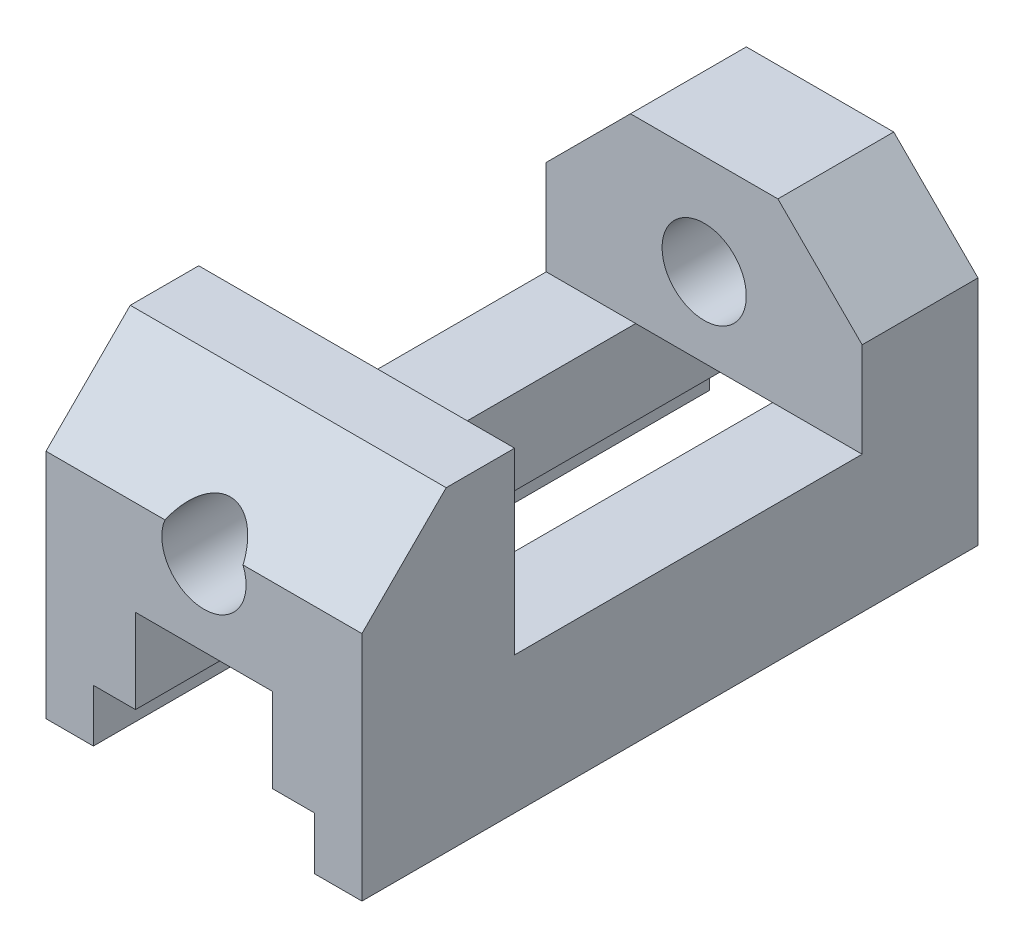
ISO-10303-21;
HEADER;
FILE_DESCRIPTION(('STEP AP214'),'2;1');
FILE_NAME('part.step','',(''),(''),'','','');
FILE_SCHEMA(('AUTOMOTIVE_DESIGN { 1 0 10303 214 1 1 1 1 }'));
ENDSEC;
DATA;
#1=APPLICATION_CONTEXT('core data for automotive mechanical design processes');
#2=APPLICATION_PROTOCOL_DEFINITION('international standard','automotive_design',2000,#1);
#3=PRODUCT_CONTEXT('',#1,'mechanical');
#4=PRODUCT('Part','Part','',(#3));
#5=PRODUCT_RELATED_PRODUCT_CATEGORY('part','',(#4));
#6=PRODUCT_DEFINITION_FORMATION('','',#4);
#7=PRODUCT_DEFINITION_CONTEXT('part definition',#1,'design');
#8=PRODUCT_DEFINITION('design','',#6,#7);
#9=PRODUCT_DEFINITION_SHAPE('','',#8);
#10=(LENGTH_UNIT() NAMED_UNIT(*) SI_UNIT(.MILLI.,.METRE.));
#11=(NAMED_UNIT(*) PLANE_ANGLE_UNIT() SI_UNIT($,.RADIAN.));
#12=(NAMED_UNIT(*) SI_UNIT($,.STERADIAN.) SOLID_ANGLE_UNIT());
#13=UNCERTAINTY_MEASURE_WITH_UNIT(LENGTH_MEASURE(1.E-05),#10,'distance_accuracy_value','');
#14=(GEOMETRIC_REPRESENTATION_CONTEXT(3) GLOBAL_UNCERTAINTY_ASSIGNED_CONTEXT((#13)) GLOBAL_UNIT_ASSIGNED_CONTEXT((#10,
#11,#12)) REPRESENTATION_CONTEXT('',''));
#15=CARTESIAN_POINT('',(0.,0.,0.));
#16=DIRECTION('',(0.,0.,1.));
#17=DIRECTION('',(1.,0.,0.));
#18=AXIS2_PLACEMENT_3D('',#15,#16,#17);
#19=CARTESIAN_POINT('',(0.,19.,117.));
#20=DIRECTION('',(0.,-1.,0.));
#21=DIRECTION('',(1.,0.,0.));
#22=AXIS2_PLACEMENT_3D('',#19,#20,#21);
#23=PLANE('',#22);
#24=DIRECTION('',(0.,0.,-1.));
#25=VECTOR('',#24,1.);
#26=CARTESIAN_POINT('',(14.,19.,44.6274169979694));
#27=LINE('',#26,#25);
#28=CARTESIAN_POINT('',(14.,19.,22.));
#29=VERTEX_POINT('',#28);
#30=CARTESIAN_POINT('',(14.,19.,0.));
#31=VERTEX_POINT('',#30);
#32=EDGE_CURVE('E67',#29,#31,#27,.T.);
#33=ORIENTED_EDGE('',*,*,#32,.T.);
#34=DIRECTION('',(-1.,0.,0.));
#35=VECTOR('',#34,1.);
#36=CARTESIAN_POINT('',(0.,19.,0.));
#37=LINE('',#36,#35);
#38=CARTESIAN_POINT('',(-14.,19.,0.));
#39=VERTEX_POINT('',#38);
#40=EDGE_CURVE('E204',#31,#39,#37,.T.);
#41=ORIENTED_EDGE('',*,*,#40,.T.);
#42=DIRECTION('',(0.,0.,-1.));
#43=VECTOR('',#42,1.);
#44=CARTESIAN_POINT('',(-14.,19.,44.6274169979694));
#45=LINE('',#44,#43);
#46=CARTESIAN_POINT('',(-14.,19.,22.));
#47=VERTEX_POINT('',#46);
#48=EDGE_CURVE('E430',#47,#39,#45,.T.);
#49=ORIENTED_EDGE('',*,*,#48,.F.);
#50=DIRECTION('',(1.,0.,0.));
#51=VECTOR('',#50,1.);
#52=CARTESIAN_POINT('',(-30.,19.,22.));
#53=LINE('',#52,#51);
#54=EDGE_CURVE('E206',#47,#29,#53,.T.);
#55=ORIENTED_EDGE('',*,*,#54,.T.);
#56=EDGE_LOOP('',(#33,#41,#49,#55));
#57=FACE_BOUND('',#56,.T.);
#58=ADVANCED_FACE('F41',(#57),#23,.F.);
#59=CARTESIAN_POINT('',(30.,0.,117.));
#60=DIRECTION('',(1.,0.,0.));
#61=DIRECTION('',(0.,1.,0.));
#62=AXIS2_PLACEMENT_3D('',#59,#60,#61);
#63=PLANE('',#62);
#64=DIRECTION('',(0.,-1.,0.));
#65=VECTOR('',#64,1.);
#66=CARTESIAN_POINT('',(30.,0.,0.));
#67=LINE('',#66,#65);
#68=CARTESIAN_POINT('',(30.,3.00000000000018,0.));
#69=VERTEX_POINT('',#68);
#70=CARTESIAN_POINT('',(30.,-41.,0.));
#71=VERTEX_POINT('',#70);
#72=EDGE_CURVE('E216',#69,#71,#67,.T.);
#73=ORIENTED_EDGE('',*,*,#72,.F.);
#74=DIRECTION('',(0.,0.,-1.));
#75=VECTOR('',#74,1.);
#76=CARTESIAN_POINT('',(30.,3.00000000000018,44.6274169979694));
#77=LINE('',#76,#75);
#78=CARTESIAN_POINT('',(30.,3.00000000000018,22.));
#79=VERTEX_POINT('',#78);
#80=EDGE_CURVE('E193',#79,#69,#77,.T.);
#81=ORIENTED_EDGE('',*,*,#80,.F.);
#82=DIRECTION('',(0.,1.,0.));
#83=VECTOR('',#82,1.);
#84=CARTESIAN_POINT('',(30.,-15.,22.));
#85=LINE('',#84,#83);
#86=CARTESIAN_POINT('',(30.,-15.,22.));
#87=VERTEX_POINT('',#86);
#88=EDGE_CURVE('E455',#87,#79,#85,.T.);
#89=ORIENTED_EDGE('',*,*,#88,.F.);
#90=DIRECTION('',(0.,0.,-1.));
#91=VECTOR('',#90,1.);
#92=CARTESIAN_POINT('',(30.,-15.,88.));
#93=LINE('',#92,#91);
#94=CARTESIAN_POINT('',(30.,-15.,88.));
#95=VERTEX_POINT('',#94);
#96=EDGE_CURVE('E451',#95,#87,#93,.T.);
#97=ORIENTED_EDGE('',*,*,#96,.F.);
#98=DIRECTION('',(0.,-1.,0.));
#99=VECTOR('',#98,1.);
#100=CARTESIAN_POINT('',(30.,19.,88.));
#101=LINE('',#100,#99);
#102=CARTESIAN_POINT('',(30.,19.,88.));
#103=VERTEX_POINT('',#102);
#104=EDGE_CURVE('E447',#103,#95,#101,.T.);
#105=ORIENTED_EDGE('',*,*,#104,.F.);
#106=DIRECTION('',(0.,0.,-1.));
#107=VECTOR('',#106,1.);
#108=CARTESIAN_POINT('',(30.,19.,117.));
#109=LINE('',#108,#107);
#110=CARTESIAN_POINT('',(30.,19.,101.));
#111=VERTEX_POINT('',#110);
#112=EDGE_CURVE('E256',#111,#103,#109,.T.);
#113=ORIENTED_EDGE('',*,*,#112,.F.);
#114=DIRECTION('',(0.,0.707106781186546,-0.707106781186549));
#115=VECTOR('',#114,1.);
#116=CARTESIAN_POINT('',(30.,3.,117.));
#117=LINE('',#116,#115);
#118=CARTESIAN_POINT('',(30.,3.,117.));
#119=VERTEX_POINT('',#118);
#120=EDGE_CURVE('E438',#119,#111,#117,.T.);
#121=ORIENTED_EDGE('',*,*,#120,.F.);
#122=DIRECTION('',(0.,-1.,0.));
#123=VECTOR('',#122,1.);
#124=CARTESIAN_POINT('',(30.,0.,117.));
#125=LINE('',#124,#123);
#126=CARTESIAN_POINT('',(30.,-41.,117.));
#127=VERTEX_POINT('',#126);
#128=EDGE_CURVE('E337',#119,#127,#125,.T.);
#129=ORIENTED_EDGE('',*,*,#128,.T.);
#130=DIRECTION('',(0.,0.,-1.));
#131=VECTOR('',#130,1.);
#132=CARTESIAN_POINT('',(30.,-41.,117.));
#133=LINE('',#132,#131);
#134=EDGE_CURVE('E260',#127,#71,#133,.T.);
#135=ORIENTED_EDGE('',*,*,#134,.T.);
#136=EDGE_LOOP('',(#73,#81,#89,#97,#105,#113,#121,#129,#135));
#137=FACE_BOUND('',#136,.T.);
#138=ADVANCED_FACE('F497',(#137),#63,.T.);
#139=CARTESIAN_POINT('',(0.,0.,0.));
#140=DIRECTION('',(0.,0.,1.));
#141=DIRECTION('',(1.,0.,0.));
#142=AXIS2_PLACEMENT_3D('',#139,#140,#141);
#143=PLANE('',#142);
#144=CARTESIAN_POINT('',(0.,0.,0.));
#145=DIRECTION('',(0.,0.,1.));
#146=DIRECTION('',(1.,0.,0.));
#147=AXIS2_PLACEMENT_3D('',#144,#145,#146);
#148=CIRCLE('',#147,8.);
#149=CARTESIAN_POINT('',(8.,0.,0.));
#150=VERTEX_POINT('',#149);
#151=EDGE_CURVE('E310',#150,#150,#148,.T.);
#152=ORIENTED_EDGE('',*,*,#151,.T.);
#153=EDGE_LOOP('',(#152));
#154=FACE_BOUND('',#153,.T.);
#155=DIRECTION('',(0.707106781186551,-0.707106781186544,0.));
#156=VECTOR('',#155,1.);
#157=CARTESIAN_POINT('',(16.4999999999999,16.5000000000001,0.));
#158=LINE('',#157,#156);
#159=EDGE_CURVE('E190',#31,#69,#158,.T.);
#160=ORIENTED_EDGE('',*,*,#159,.T.);
#161=ORIENTED_EDGE('',*,*,#72,.T.);
#162=DIRECTION('',(-1.,0.,0.));
#163=VECTOR('',#162,1.);
#164=CARTESIAN_POINT('',(0.,-41.,0.));
#165=LINE('',#164,#163);
#166=CARTESIAN_POINT('',(21.,-41.,0.));
#167=VERTEX_POINT('',#166);
#168=EDGE_CURVE('E222',#71,#167,#165,.T.);
#169=ORIENTED_EDGE('',*,*,#168,.T.);
#170=DIRECTION('',(0.,1.,0.));
#171=VECTOR('',#170,1.);
#172=CARTESIAN_POINT('',(21.,0.,0.));
#173=LINE('',#172,#171);
#174=CARTESIAN_POINT('',(21.,-31.,0.));
#175=VERTEX_POINT('',#174);
#176=EDGE_CURVE('E370',#167,#175,#173,.T.);
#177=ORIENTED_EDGE('',*,*,#176,.T.);
#178=DIRECTION('',(-1.,0.,0.));
#179=VECTOR('',#178,1.);
#180=CARTESIAN_POINT('',(0.,-31.,0.));
#181=LINE('',#180,#179);
#182=CARTESIAN_POINT('',(13.,-31.,0.));
#183=VERTEX_POINT('',#182);
#184=EDGE_CURVE('E366',#175,#183,#181,.T.);
#185=ORIENTED_EDGE('',*,*,#184,.T.);
#186=DIRECTION('',(0.,1.,0.));
#187=VECTOR('',#186,1.);
#188=CARTESIAN_POINT('',(13.,0.,0.));
#189=LINE('',#188,#187);
#190=CARTESIAN_POINT('',(13.,-15.,0.));
#191=VERTEX_POINT('',#190);
#192=EDGE_CURVE('E362',#183,#191,#189,.T.);
#193=ORIENTED_EDGE('',*,*,#192,.T.);
#194=DIRECTION('',(-1.,0.,0.));
#195=VECTOR('',#194,1.);
#196=CARTESIAN_POINT('',(0.,-15.,0.));
#197=LINE('',#196,#195);
#198=CARTESIAN_POINT('',(-13.,-15.,0.));
#199=VERTEX_POINT('',#198);
#200=EDGE_CURVE('E358',#191,#199,#197,.T.);
#201=ORIENTED_EDGE('',*,*,#200,.T.);
#202=DIRECTION('',(0.,1.,0.));
#203=VECTOR('',#202,1.);
#204=CARTESIAN_POINT('',(-13.,0.,0.));
#205=LINE('',#204,#203);
#206=CARTESIAN_POINT('',(-13.,-31.,0.));
#207=VERTEX_POINT('',#206);
#208=EDGE_CURVE('E354',#207,#199,#205,.T.);
#209=ORIENTED_EDGE('',*,*,#208,.F.);
#210=DIRECTION('',(1.,0.,0.));
#211=VECTOR('',#210,1.);
#212=CARTESIAN_POINT('',(0.,-31.,0.));
#213=LINE('',#212,#211);
#214=CARTESIAN_POINT('',(-21.,-31.,0.));
#215=VERTEX_POINT('',#214);
#216=EDGE_CURVE('E231',#215,#207,#213,.T.);
#217=ORIENTED_EDGE('',*,*,#216,.F.);
#218=DIRECTION('',(0.,1.,0.));
#219=VECTOR('',#218,1.);
#220=CARTESIAN_POINT('',(-21.,0.,0.));
#221=LINE('',#220,#219);
#222=CARTESIAN_POINT('',(-21.,-41.,0.));
#223=VERTEX_POINT('',#222);
#224=EDGE_CURVE('E228',#223,#215,#221,.T.);
#225=ORIENTED_EDGE('',*,*,#224,.F.);
#226=DIRECTION('',(1.,0.,0.));
#227=VECTOR('',#226,1.);
#228=CARTESIAN_POINT('',(0.,-41.,0.));
#229=LINE('',#228,#227);
#230=CARTESIAN_POINT('',(-30.,-41.,0.));
#231=VERTEX_POINT('',#230);
#232=EDGE_CURVE('E220',#231,#223,#229,.T.);
#233=ORIENTED_EDGE('',*,*,#232,.F.);
#234=DIRECTION('',(0.,-1.,0.));
#235=VECTOR('',#234,1.);
#236=CARTESIAN_POINT('',(-30.,0.,0.));
#237=LINE('',#236,#235);
#238=CARTESIAN_POINT('',(-30.,3.00000000000018,0.));
#239=VERTEX_POINT('',#238);
#240=EDGE_CURVE('E215',#239,#231,#237,.T.);
#241=ORIENTED_EDGE('',*,*,#240,.F.);
#242=DIRECTION('',(-0.707106781186551,-0.707106781186544,0.));
#243=VECTOR('',#242,1.);
#244=CARTESIAN_POINT('',(-16.4999999999999,16.5000000000001,0.));
#245=LINE('',#244,#243);
#246=EDGE_CURVE('E213',#39,#239,#245,.T.);
#247=ORIENTED_EDGE('',*,*,#246,.F.);
#248=ORIENTED_EDGE('',*,*,#40,.F.);
#249=EDGE_LOOP('',(#160,#161,#169,#177,#185,#193,#201,#209,#217,#225,#233,#241,#247,#248));
#250=FACE_BOUND('',#249,.T.);
#251=ADVANCED_FACE('F211',(#154,#250),#143,.F.);
#252=CARTESIAN_POINT('',(-30.,-15.,22.));
#253=DIRECTION('',(0.,0.,-1.));
#254=DIRECTION('',(-1.,0.,0.));
#255=AXIS2_PLACEMENT_3D('',#252,#253,#254);
#256=PLANE('',#255);
#257=CARTESIAN_POINT('',(0.,0.,22.));
#258=DIRECTION('',(0.,0.,-1.));
#259=DIRECTION('',(-1.,0.,0.));
#260=AXIS2_PLACEMENT_3D('',#257,#258,#259);
#261=CIRCLE('',#260,8.);
#262=CARTESIAN_POINT('',(-8.,0.,22.));
#263=VERTEX_POINT('',#262);
#264=EDGE_CURVE('E45',#263,#263,#261,.T.);
#265=ORIENTED_EDGE('',*,*,#264,.T.);
#266=EDGE_LOOP('',(#265));
#267=FACE_BOUND('',#266,.T.);
#268=DIRECTION('',(-0.707106781186551,0.707106781186544,0.));
#269=VECTOR('',#268,1.);
#270=CARTESIAN_POINT('',(16.4999999999999,16.5000000000001,22.));
#271=LINE('',#270,#269);
#272=EDGE_CURVE('E208',#79,#29,#271,.T.);
#273=ORIENTED_EDGE('',*,*,#272,.T.);
#274=ORIENTED_EDGE('',*,*,#54,.F.);
#275=DIRECTION('',(0.707106781186551,0.707106781186544,0.));
#276=VECTOR('',#275,1.);
#277=CARTESIAN_POINT('',(-16.4999999999999,16.5000000000001,22.));
#278=LINE('',#277,#276);
#279=CARTESIAN_POINT('',(-30.,3.00000000000018,22.));
#280=VERTEX_POINT('',#279);
#281=EDGE_CURVE('E198',#280,#47,#278,.T.);
#282=ORIENTED_EDGE('',*,*,#281,.F.);
#283=DIRECTION('',(0.,1.,0.));
#284=VECTOR('',#283,1.);
#285=CARTESIAN_POINT('',(-30.,-15.,22.));
#286=LINE('',#285,#284);
#287=CARTESIAN_POINT('',(-30.,-15.,22.));
#288=VERTEX_POINT('',#287);
#289=EDGE_CURVE('E428',#288,#280,#286,.T.);
#290=ORIENTED_EDGE('',*,*,#289,.F.);
#291=DIRECTION('',(1.,0.,0.));
#292=VECTOR('',#291,1.);
#293=CARTESIAN_POINT('',(-30.,-15.,22.));
#294=LINE('',#293,#292);
#295=CARTESIAN_POINT('',(-13.,-15.,22.));
#296=VERTEX_POINT('',#295);
#297=EDGE_CURVE('E470',#288,#296,#294,.T.);
#298=ORIENTED_EDGE('',*,*,#297,.T.);
#299=CARTESIAN_POINT('',(13.,-15.,22.));
#300=VERTEX_POINT('',#299);
#301=EDGE_CURVE('E401',#296,#300,#294,.T.);
#302=ORIENTED_EDGE('',*,*,#301,.T.);
#303=EDGE_CURVE('E473',#300,#87,#294,.T.);
#304=ORIENTED_EDGE('',*,*,#303,.T.);
#305=ORIENTED_EDGE('',*,*,#88,.T.);
#306=EDGE_LOOP('',(#273,#274,#282,#290,#298,#302,#304,#305));
#307=FACE_BOUND('',#306,.T.);
#308=ADVANCED_FACE('F601',(#267,#307),#256,.F.);
#309=CARTESIAN_POINT('',(0.,-15.,117.));
#310=DIRECTION('',(0.,-1.,0.));
#311=DIRECTION('',(0.,0.,-1.));
#312=AXIS2_PLACEMENT_3D('',#309,#310,#311);
#313=PLANE('',#312);
#314=ORIENTED_EDGE('',*,*,#301,.F.);
#315=DIRECTION('',(0.,0.,-1.));
#316=VECTOR('',#315,1.);
#317=CARTESIAN_POINT('',(-13.,-15.,117.));
#318=LINE('',#317,#316);
#319=EDGE_CURVE('E278',#296,#199,#318,.T.);
#320=ORIENTED_EDGE('',*,*,#319,.T.);
#321=ORIENTED_EDGE('',*,*,#200,.F.);
#322=DIRECTION('',(0.,0.,-1.));
#323=VECTOR('',#322,1.);
#324=CARTESIAN_POINT('',(13.,-15.,117.));
#325=LINE('',#324,#323);
#326=EDGE_CURVE('E273',#300,#191,#325,.T.);
#327=ORIENTED_EDGE('',*,*,#326,.F.);
#328=EDGE_LOOP('',(#314,#320,#321,#327));
#329=FACE_BOUND('',#328,.T.);
#330=ADVANCED_FACE('F399',(#329),#313,.T.);
#331=CARTESIAN_POINT('',(0.,0.,117.));
#332=DIRECTION('',(0.,0.,-1.));
#333=DIRECTION('',(-1.,0.,0.));
#334=AXIS2_PLACEMENT_3D('',#331,#332,#333);
#335=CYLINDRICAL_SURFACE('',#334,8.);
#336=ORIENTED_EDGE('',*,*,#264,.F.);
#337=EDGE_LOOP('',(#336));
#338=FACE_BOUND('',#337,.T.);
#339=ORIENTED_EDGE('',*,*,#151,.F.);
#340=EDGE_LOOP('',(#339));
#341=FACE_BOUND('',#340,.T.);
#342=ADVANCED_FACE('F509',(#338,#341),#335,.F.);
#343=CARTESIAN_POINT('',(-13.,0.,117.));
#344=DIRECTION('',(-1.,0.,0.));
#345=DIRECTION('',(0.,0.,1.));
#346=AXIS2_PLACEMENT_3D('',#343,#344,#345);
#347=PLANE('',#346);
#348=ORIENTED_EDGE('',*,*,#208,.T.);
#349=ORIENTED_EDGE('',*,*,#319,.F.);
#350=DIRECTION('',(0.,0.,1.));
#351=VECTOR('',#350,1.);
#352=CARTESIAN_POINT('',(-13.,-15.,117.));
#353=LINE('',#352,#351);
#354=CARTESIAN_POINT('',(-13.,-15.,88.));
#355=VERTEX_POINT('',#354);
#356=EDGE_CURVE('E306',#296,#355,#353,.T.);
#357=ORIENTED_EDGE('',*,*,#356,.T.);
#358=CARTESIAN_POINT('',(-13.,-15.,117.));
#359=VERTEX_POINT('',#358);
#360=EDGE_CURVE('E51',#359,#355,#318,.T.);
#361=ORIENTED_EDGE('',*,*,#360,.F.);
#362=DIRECTION('',(0.,1.,0.));
#363=VECTOR('',#362,1.);
#364=CARTESIAN_POINT('',(-13.,0.,117.));
#365=LINE('',#364,#363);
#366=CARTESIAN_POINT('',(-13.,-31.,117.));
#367=VERTEX_POINT('',#366);
#368=EDGE_CURVE('E314',#367,#359,#365,.T.);
#369=ORIENTED_EDGE('',*,*,#368,.F.);
#370=DIRECTION('',(0.,0.,-1.));
#371=VECTOR('',#370,1.);
#372=CARTESIAN_POINT('',(-13.,-31.,117.));
#373=LINE('',#372,#371);
#374=EDGE_CURVE('E235',#367,#207,#373,.T.);
#375=ORIENTED_EDGE('',*,*,#374,.T.);
#376=EDGE_LOOP('',(#348,#349,#357,#361,#369,#375));
#377=FACE_BOUND('',#376,.T.);
#378=ADVANCED_FACE('F404',(#377),#347,.F.);
#379=DIRECTION('',(1.,0.,0.));
#380=VECTOR('',#379,1.);
#381=CARTESIAN_POINT('',(-30.,-15.,88.));
#382=LINE('',#381,#380);
#383=CARTESIAN_POINT('',(13.,-15.,88.));
#384=VERTEX_POINT('',#383);
#385=EDGE_CURVE('E477',#355,#384,#382,.T.);
#386=ORIENTED_EDGE('',*,*,#385,.T.);
#387=CARTESIAN_POINT('',(13.,-15.,117.));
#388=VERTEX_POINT('',#387);
#389=EDGE_CURVE('E274',#388,#384,#325,.T.);
#390=ORIENTED_EDGE('',*,*,#389,.F.);
#391=DIRECTION('',(-1.,0.,0.));
#392=VECTOR('',#391,1.);
#393=CARTESIAN_POINT('',(0.,-15.,117.));
#394=LINE('',#393,#392);
#395=EDGE_CURVE('E317',#388,#359,#394,.T.);
#396=ORIENTED_EDGE('',*,*,#395,.T.);
#397=ORIENTED_EDGE('',*,*,#360,.T.);
#398=EDGE_LOOP('',(#386,#390,#396,#397));
#399=FACE_BOUND('',#398,.T.);
#400=ADVANCED_FACE('F540',(#399),#313,.T.);
#401=CARTESIAN_POINT('',(13.,0.,117.));
#402=DIRECTION('',(-1.,0.,0.));
#403=DIRECTION('',(0.,0.,1.));
#404=AXIS2_PLACEMENT_3D('',#401,#402,#403);
#405=PLANE('',#404);
#406=ORIENTED_EDGE('',*,*,#192,.F.);
#407=DIRECTION('',(0.,0.,-1.));
#408=VECTOR('',#407,1.);
#409=CARTESIAN_POINT('',(13.,-31.,117.));
#410=LINE('',#409,#408);
#411=CARTESIAN_POINT('',(13.,-31.,117.));
#412=VERTEX_POINT('',#411);
#413=EDGE_CURVE('E270',#412,#183,#410,.T.);
#414=ORIENTED_EDGE('',*,*,#413,.F.);
#415=DIRECTION('',(0.,1.,0.));
#416=VECTOR('',#415,1.);
#417=CARTESIAN_POINT('',(13.,0.,117.));
#418=LINE('',#417,#416);
#419=EDGE_CURVE('E321',#412,#388,#418,.T.);
#420=ORIENTED_EDGE('',*,*,#419,.T.);
#421=ORIENTED_EDGE('',*,*,#389,.T.);
#422=DIRECTION('',(0.,0.,1.));
#423=VECTOR('',#422,1.);
#424=CARTESIAN_POINT('',(13.,-15.,117.));
#425=LINE('',#424,#423);
#426=EDGE_CURVE('E290',#300,#384,#425,.T.);
#427=ORIENTED_EDGE('',*,*,#426,.F.);
#428=ORIENTED_EDGE('',*,*,#326,.T.);
#429=EDGE_LOOP('',(#406,#414,#420,#421,#427,#428));
#430=FACE_BOUND('',#429,.T.);
#431=ADVANCED_FACE('F392',(#430),#405,.T.);
#432=CARTESIAN_POINT('',(0.,-31.,117.));
#433=DIRECTION('',(0.,-1.,0.));
#434=DIRECTION('',(1.,0.,0.));
#435=AXIS2_PLACEMENT_3D('',#432,#433,#434);
#436=PLANE('',#435);
#437=ORIENTED_EDGE('',*,*,#184,.F.);
#438=DIRECTION('',(0.,0.,-1.));
#439=VECTOR('',#438,1.);
#440=CARTESIAN_POINT('',(21.,-31.,117.));
#441=LINE('',#440,#439);
#442=CARTESIAN_POINT('',(21.,-31.,117.));
#443=VERTEX_POINT('',#442);
#444=EDGE_CURVE('E267',#443,#175,#441,.T.);
#445=ORIENTED_EDGE('',*,*,#444,.F.);
#446=DIRECTION('',(-1.,0.,0.));
#447=VECTOR('',#446,1.);
#448=CARTESIAN_POINT('',(0.,-31.,117.));
#449=LINE('',#448,#447);
#450=EDGE_CURVE('E325',#443,#412,#449,.T.);
#451=ORIENTED_EDGE('',*,*,#450,.T.);
#452=ORIENTED_EDGE('',*,*,#413,.T.);
#453=EDGE_LOOP('',(#437,#445,#451,#452));
#454=FACE_BOUND('',#453,.T.);
#455=ADVANCED_FACE('F387',(#454),#436,.T.);
#456=CARTESIAN_POINT('',(21.,0.,117.));
#457=DIRECTION('',(-1.,0.,0.));
#458=DIRECTION('',(0.,0.,1.));
#459=AXIS2_PLACEMENT_3D('',#456,#457,#458);
#460=PLANE('',#459);
#461=ORIENTED_EDGE('',*,*,#176,.F.);
#462=DIRECTION('',(0.,0.,-1.));
#463=VECTOR('',#462,1.);
#464=CARTESIAN_POINT('',(21.,-41.,117.));
#465=LINE('',#464,#463);
#466=CARTESIAN_POINT('',(21.,-41.,117.));
#467=VERTEX_POINT('',#466);
#468=EDGE_CURVE('E264',#467,#167,#465,.T.);
#469=ORIENTED_EDGE('',*,*,#468,.F.);
#470=DIRECTION('',(0.,1.,0.));
#471=VECTOR('',#470,1.);
#472=CARTESIAN_POINT('',(21.,0.,117.));
#473=LINE('',#472,#471);
#474=EDGE_CURVE('E329',#467,#443,#473,.T.);
#475=ORIENTED_EDGE('',*,*,#474,.T.);
#476=ORIENTED_EDGE('',*,*,#444,.T.);
#477=EDGE_LOOP('',(#461,#469,#475,#476));
#478=FACE_BOUND('',#477,.T.);
#479=ADVANCED_FACE('F383',(#478),#460,.T.);
#480=CARTESIAN_POINT('',(0.,-41.,117.));
#481=DIRECTION('',(0.,-1.,0.));
#482=DIRECTION('',(0.,0.,-1.));
#483=AXIS2_PLACEMENT_3D('',#480,#481,#482);
#484=PLANE('',#483);
#485=ORIENTED_EDGE('',*,*,#168,.F.);
#486=ORIENTED_EDGE('',*,*,#134,.F.);
#487=DIRECTION('',(-1.,0.,0.));
#488=VECTOR('',#487,1.);
#489=CARTESIAN_POINT('',(0.,-41.,117.));
#490=LINE('',#489,#488);
#491=EDGE_CURVE('E333',#127,#467,#490,.T.);
#492=ORIENTED_EDGE('',*,*,#491,.T.);
#493=ORIENTED_EDGE('',*,*,#468,.T.);
#494=EDGE_LOOP('',(#485,#486,#492,#493));
#495=FACE_BOUND('',#494,.T.);
#496=ADVANCED_FACE('F379',(#495),#484,.T.);
#497=DIRECTION('',(0.,0.,-1.));
#498=VECTOR('',#497,1.);
#499=CARTESIAN_POINT('',(-30.,19.,117.));
#500=LINE('',#499,#498);
#501=CARTESIAN_POINT('',(-30.,19.,101.));
#502=VERTEX_POINT('',#501);
#503=CARTESIAN_POINT('',(-30.,19.,88.));
#504=VERTEX_POINT('',#503);
#505=EDGE_CURVE('E252',#502,#504,#500,.T.);
#506=ORIENTED_EDGE('',*,*,#505,.F.);
#507=DIRECTION('',(1.,0.,0.));
#508=VECTOR('',#507,1.);
#509=CARTESIAN_POINT('',(-30.,19.,101.));
#510=LINE('',#509,#508);
#511=EDGE_CURVE('E291',#502,#111,#510,.T.);
#512=ORIENTED_EDGE('',*,*,#511,.T.);
#513=ORIENTED_EDGE('',*,*,#112,.T.);
#514=DIRECTION('',(1.,0.,0.));
#515=VECTOR('',#514,1.);
#516=CARTESIAN_POINT('',(-30.,19.,88.));
#517=LINE('',#516,#515);
#518=EDGE_CURVE('E302',#504,#103,#517,.T.);
#519=ORIENTED_EDGE('',*,*,#518,.F.);
#520=EDGE_LOOP('',(#506,#512,#513,#519));
#521=FACE_BOUND('',#520,.T.);
#522=ADVANCED_FACE('F500',(#521),#23,.F.);
#523=CARTESIAN_POINT('',(-30.,0.,117.));
#524=DIRECTION('',(1.,0.,0.));
#525=DIRECTION('',(0.,1.,0.));
#526=AXIS2_PLACEMENT_3D('',#523,#524,#525);
#527=PLANE('',#526);
#528=ORIENTED_EDGE('',*,*,#289,.T.);
#529=DIRECTION('',(0.,0.,-1.));
#530=VECTOR('',#529,1.);
#531=CARTESIAN_POINT('',(-30.,3.00000000000018,44.6274169979694));
#532=LINE('',#531,#530);
#533=EDGE_CURVE('E59',#280,#239,#532,.T.);
#534=ORIENTED_EDGE('',*,*,#533,.T.);
#535=ORIENTED_EDGE('',*,*,#240,.T.);
#536=DIRECTION('',(0.,0.,-1.));
#537=VECTOR('',#536,1.);
#538=CARTESIAN_POINT('',(-30.,-41.,117.));
#539=LINE('',#538,#537);
#540=CARTESIAN_POINT('',(-30.,-41.,117.));
#541=VERTEX_POINT('',#540);
#542=EDGE_CURVE('E248',#541,#231,#539,.T.);
#543=ORIENTED_EDGE('',*,*,#542,.F.);
#544=DIRECTION('',(0.,-1.,0.));
#545=VECTOR('',#544,1.);
#546=CARTESIAN_POINT('',(-30.,0.,117.));
#547=LINE('',#546,#545);
#548=CARTESIAN_POINT('',(-30.,3.,117.));
#549=VERTEX_POINT('',#548);
#550=EDGE_CURVE('E340',#549,#541,#547,.T.);
#551=ORIENTED_EDGE('',*,*,#550,.F.);
#552=DIRECTION('',(0.,0.707106781186546,-0.707106781186549));
#553=VECTOR('',#552,1.);
#554=CARTESIAN_POINT('',(-30.,3.,117.));
#555=LINE('',#554,#553);
#556=EDGE_CURVE('E441',#549,#502,#555,.T.);
#557=ORIENTED_EDGE('',*,*,#556,.T.);
#558=ORIENTED_EDGE('',*,*,#505,.T.);
#559=DIRECTION('',(0.,-1.,0.));
#560=VECTOR('',#559,1.);
#561=CARTESIAN_POINT('',(-30.,19.,88.));
#562=LINE('',#561,#560);
#563=CARTESIAN_POINT('',(-30.,-15.,88.));
#564=VERTEX_POINT('',#563);
#565=EDGE_CURVE('E459',#504,#564,#562,.T.);
#566=ORIENTED_EDGE('',*,*,#565,.T.);
#567=DIRECTION('',(0.,0.,-1.));
#568=VECTOR('',#567,1.);
#569=CARTESIAN_POINT('',(-30.,-15.,88.));
#570=LINE('',#569,#568);
#571=EDGE_CURVE('E463',#564,#288,#570,.T.);
#572=ORIENTED_EDGE('',*,*,#571,.T.);
#573=EDGE_LOOP('',(#528,#534,#535,#543,#551,#557,#558,#566,#572));
#574=FACE_BOUND('',#573,.T.);
#575=ADVANCED_FACE('F424',(#574),#527,.F.);
#576=CARTESIAN_POINT('',(0.,-41.,117.));
#577=DIRECTION('',(0.,1.,0.));
#578=DIRECTION('',(0.,0.,1.));
#579=AXIS2_PLACEMENT_3D('',#576,#577,#578);
#580=PLANE('',#579);
#581=ORIENTED_EDGE('',*,*,#232,.T.);
#582=DIRECTION('',(0.,0.,-1.));
#583=VECTOR('',#582,1.);
#584=CARTESIAN_POINT('',(-21.,-41.,117.));
#585=LINE('',#584,#583);
#586=CARTESIAN_POINT('',(-21.,-41.,117.));
#587=VERTEX_POINT('',#586);
#588=EDGE_CURVE('E244',#587,#223,#585,.T.);
#589=ORIENTED_EDGE('',*,*,#588,.F.);
#590=DIRECTION('',(1.,0.,0.));
#591=VECTOR('',#590,1.);
#592=CARTESIAN_POINT('',(0.,-41.,117.));
#593=LINE('',#592,#591);
#594=EDGE_CURVE('E343',#541,#587,#593,.T.);
#595=ORIENTED_EDGE('',*,*,#594,.F.);
#596=ORIENTED_EDGE('',*,*,#542,.T.);
#597=EDGE_LOOP('',(#581,#589,#595,#596));
#598=FACE_BOUND('',#597,.T.);
#599=ADVANCED_FACE('F420',(#598),#580,.F.);
#600=CARTESIAN_POINT('',(-21.,0.,117.));
#601=DIRECTION('',(-1.,0.,0.));
#602=DIRECTION('',(0.,0.,1.));
#603=AXIS2_PLACEMENT_3D('',#600,#601,#602);
#604=PLANE('',#603);
#605=ORIENTED_EDGE('',*,*,#224,.T.);
#606=DIRECTION('',(0.,0.,-1.));
#607=VECTOR('',#606,1.);
#608=CARTESIAN_POINT('',(-21.,-31.,117.));
#609=LINE('',#608,#607);
#610=CARTESIAN_POINT('',(-21.,-31.,117.));
#611=VERTEX_POINT('',#610);
#612=EDGE_CURVE('E239',#611,#215,#609,.T.);
#613=ORIENTED_EDGE('',*,*,#612,.F.);
#614=DIRECTION('',(0.,1.,0.));
#615=VECTOR('',#614,1.);
#616=CARTESIAN_POINT('',(-21.,0.,117.));
#617=LINE('',#616,#615);
#618=EDGE_CURVE('E346',#587,#611,#617,.T.);
#619=ORIENTED_EDGE('',*,*,#618,.F.);
#620=ORIENTED_EDGE('',*,*,#588,.T.);
#621=EDGE_LOOP('',(#605,#613,#619,#620));
#622=FACE_BOUND('',#621,.T.);
#623=ADVANCED_FACE('F416',(#622),#604,.F.);
#624=CARTESIAN_POINT('',(0.,0.,120.));
#625=DIRECTION('',(0.,-0.707106781186549,-0.707106781186546));
#626=DIRECTION('',(0.,0.707106781186546,-0.707106781186549));
#627=AXIS2_PLACEMENT_3D('',#624,#625,#626);
#628=ELLIPSE('',#627,11.3137084989848,8.);
#629=CARTESIAN_POINT('',(-7.41619848709566,3.,117.));
#630=VERTEX_POINT('',#629);
#631=CARTESIAN_POINT('',(7.41619848709566,3.,117.));
#632=VERTEX_POINT('',#631);
#633=EDGE_CURVE('E284',#630,#632,#628,.T.);
#634=ORIENTED_EDGE('',*,*,#633,.F.);
#635=CARTESIAN_POINT('',(0.,0.,117.));
#636=DIRECTION('',(0.,0.,1.));
#637=DIRECTION('',(1.,0.,0.));
#638=AXIS2_PLACEMENT_3D('',#635,#636,#637);
#639=CIRCLE('',#638,8.);
#640=EDGE_CURVE('E234',#630,#632,#639,.T.);
#641=ORIENTED_EDGE('',*,*,#640,.T.);
#642=EDGE_LOOP('',(#634,#641));
#643=FACE_BOUND('',#642,.T.);
#644=CARTESIAN_POINT('',(0.,0.,88.));
#645=DIRECTION('',(0.,0.,1.));
#646=DIRECTION('',(1.,0.,0.));
#647=AXIS2_PLACEMENT_3D('',#644,#645,#646);
#648=CIRCLE('',#647,8.);
#649=CARTESIAN_POINT('',(8.,0.,88.));
#650=VERTEX_POINT('',#649);
#651=EDGE_CURVE('E281',#650,#650,#648,.T.);
#652=ORIENTED_EDGE('',*,*,#651,.F.);
#653=EDGE_LOOP('',(#652));
#654=FACE_BOUND('',#653,.T.);
#655=ADVANCED_FACE('F43',(#643,#654),#335,.F.);
#656=CARTESIAN_POINT('',(0.,-31.,117.));
#657=DIRECTION('',(0.,1.,0.));
#658=DIRECTION('',(-1.,0.,0.));
#659=AXIS2_PLACEMENT_3D('',#656,#657,#658);
#660=PLANE('',#659);
#661=ORIENTED_EDGE('',*,*,#216,.T.);
#662=ORIENTED_EDGE('',*,*,#374,.F.);
#663=DIRECTION('',(1.,0.,0.));
#664=VECTOR('',#663,1.);
#665=CARTESIAN_POINT('',(0.,-31.,117.));
#666=LINE('',#665,#664);
#667=EDGE_CURVE('E240',#611,#367,#666,.T.);
#668=ORIENTED_EDGE('',*,*,#667,.F.);
#669=ORIENTED_EDGE('',*,*,#612,.T.);
#670=EDGE_LOOP('',(#661,#662,#668,#669));
#671=FACE_BOUND('',#670,.T.);
#672=ADVANCED_FACE('F411',(#671),#660,.F.);
#673=CARTESIAN_POINT('',(0.,0.,117.));
#674=DIRECTION('',(0.,0.,1.));
#675=DIRECTION('',(1.,0.,0.));
#676=AXIS2_PLACEMENT_3D('',#673,#674,#675);
#677=PLANE('',#676);
#678=DIRECTION('',(1.,0.,0.));
#679=VECTOR('',#678,1.);
#680=CARTESIAN_POINT('',(-30.,3.,117.));
#681=LINE('',#680,#679);
#682=EDGE_CURVE('E298',#549,#630,#681,.T.);
#683=ORIENTED_EDGE('',*,*,#682,.F.);
#684=ORIENTED_EDGE('',*,*,#550,.T.);
#685=ORIENTED_EDGE('',*,*,#594,.T.);
#686=ORIENTED_EDGE('',*,*,#618,.T.);
#687=ORIENTED_EDGE('',*,*,#667,.T.);
#688=ORIENTED_EDGE('',*,*,#368,.T.);
#689=ORIENTED_EDGE('',*,*,#395,.F.);
#690=ORIENTED_EDGE('',*,*,#419,.F.);
#691=ORIENTED_EDGE('',*,*,#450,.F.);
#692=ORIENTED_EDGE('',*,*,#474,.F.);
#693=ORIENTED_EDGE('',*,*,#491,.F.);
#694=ORIENTED_EDGE('',*,*,#128,.F.);
#695=DIRECTION('',(1.,0.,0.));
#696=VECTOR('',#695,1.);
#697=CARTESIAN_POINT('',(0.,3.,117.));
#698=LINE('',#697,#696);
#699=EDGE_CURVE('E11',#632,#119,#698,.T.);
#700=ORIENTED_EDGE('',*,*,#699,.F.);
#701=ORIENTED_EDGE('',*,*,#640,.F.);
#702=EDGE_LOOP('',(#683,#684,#685,#686,#687,#688,#689,#690,#691,#692,#693,#694,#700,#701));
#703=FACE_BOUND('',#702,.T.);
#704=ADVANCED_FACE('F504',(#703),#677,.T.);
#705=CARTESIAN_POINT('',(-30.,3.,117.));
#706=DIRECTION('',(0.,-0.707106781186549,-0.707106781186546));
#707=DIRECTION('',(0.,0.707106781186546,-0.707106781186549));
#708=AXIS2_PLACEMENT_3D('',#705,#706,#707);
#709=PLANE('',#708);
#710=ORIENTED_EDGE('',*,*,#633,.T.);
#711=ORIENTED_EDGE('',*,*,#699,.T.);
#712=ORIENTED_EDGE('',*,*,#120,.T.);
#713=ORIENTED_EDGE('',*,*,#511,.F.);
#714=ORIENTED_EDGE('',*,*,#556,.F.);
#715=ORIENTED_EDGE('',*,*,#682,.T.);
#716=EDGE_LOOP('',(#710,#711,#712,#713,#714,#715));
#717=FACE_BOUND('',#716,.T.);
#718=ADVANCED_FACE('F501',(#717),#709,.F.);
#719=CARTESIAN_POINT('',(-30.,-15.,88.));
#720=DIRECTION('',(0.,-1.,0.));
#721=DIRECTION('',(0.,0.,-1.));
#722=AXIS2_PLACEMENT_3D('',#719,#720,#721);
#723=PLANE('',#722);
#724=ORIENTED_EDGE('',*,*,#297,.F.);
#725=ORIENTED_EDGE('',*,*,#571,.F.);
#726=EDGE_CURVE('E474',#564,#355,#382,.T.);
#727=ORIENTED_EDGE('',*,*,#726,.T.);
#728=ORIENTED_EDGE('',*,*,#356,.F.);
#729=EDGE_LOOP('',(#724,#725,#727,#728));
#730=FACE_BOUND('',#729,.T.);
#731=ADVANCED_FACE('F627',(#730),#723,.F.);
#732=ORIENTED_EDGE('',*,*,#426,.T.);
#733=EDGE_CURVE('E478',#384,#95,#382,.T.);
#734=ORIENTED_EDGE('',*,*,#733,.T.);
#735=ORIENTED_EDGE('',*,*,#96,.T.);
#736=ORIENTED_EDGE('',*,*,#303,.F.);
#737=EDGE_LOOP('',(#732,#734,#735,#736));
#738=FACE_BOUND('',#737,.T.);
#739=ADVANCED_FACE('F636',(#738),#723,.F.);
#740=CARTESIAN_POINT('',(-30.,19.,88.));
#741=DIRECTION('',(0.,0.,1.));
#742=DIRECTION('',(1.,0.,0.));
#743=AXIS2_PLACEMENT_3D('',#740,#741,#742);
#744=PLANE('',#743);
#745=ORIENTED_EDGE('',*,*,#651,.T.);
#746=EDGE_LOOP('',(#745));
#747=FACE_BOUND('',#746,.T.);
#748=ORIENTED_EDGE('',*,*,#726,.F.);
#749=ORIENTED_EDGE('',*,*,#565,.F.);
#750=ORIENTED_EDGE('',*,*,#518,.T.);
#751=ORIENTED_EDGE('',*,*,#104,.T.);
#752=ORIENTED_EDGE('',*,*,#733,.F.);
#753=ORIENTED_EDGE('',*,*,#385,.F.);
#754=EDGE_LOOP('',(#748,#749,#750,#751,#752,#753));
#755=FACE_BOUND('',#754,.T.);
#756=ADVANCED_FACE('F491',(#747,#755),#744,.F.);
#757=CARTESIAN_POINT('',(-16.4999999999999,16.5000000000001,44.6274169979694));
#758=DIRECTION('',(0.707106781186544,-0.707106781186551,0.));
#759=DIRECTION('',(0.707106781186551,0.707106781186544,0.));
#760=AXIS2_PLACEMENT_3D('',#757,#758,#759);
#761=PLANE('',#760);
#762=ORIENTED_EDGE('',*,*,#281,.T.);
#763=ORIENTED_EDGE('',*,*,#48,.T.);
#764=ORIENTED_EDGE('',*,*,#246,.T.);
#765=ORIENTED_EDGE('',*,*,#533,.F.);
#766=EDGE_LOOP('',(#762,#763,#764,#765));
#767=FACE_BOUND('',#766,.T.);
#768=ADVANCED_FACE('F651',(#767),#761,.F.);
#769=CARTESIAN_POINT('',(16.4999999999999,16.5000000000001,44.6274169979694));
#770=DIRECTION('',(0.707106781186544,0.707106781186551,0.));
#771=DIRECTION('',(-0.707106781186551,0.707106781186544,0.));
#772=AXIS2_PLACEMENT_3D('',#769,#770,#771);
#773=PLANE('',#772);
#774=ORIENTED_EDGE('',*,*,#80,.T.);
#775=ORIENTED_EDGE('',*,*,#159,.F.);
#776=ORIENTED_EDGE('',*,*,#32,.F.);
#777=ORIENTED_EDGE('',*,*,#272,.F.);
#778=EDGE_LOOP('',(#774,#775,#776,#777));
#779=FACE_BOUND('',#778,.T.);
#780=ADVANCED_FACE('F191',(#779),#773,.T.);
#781=CLOSED_SHELL('',(#58,#138,#251,#308,#330,#342,#378,#400,#431,#455,#479,#496,#522,#575,#599,
#623,#655,#672,#704,#718,#731,#739,#756,#768,#780));
#782=MANIFOLD_SOLID_BREP('B2',#781);
#783=ADVANCED_BREP_SHAPE_REPRESENTATION('',(#18,#782),#14);
#784=SHAPE_DEFINITION_REPRESENTATION(#9,#783);
ENDSEC;
END-ISO-10303-21;
